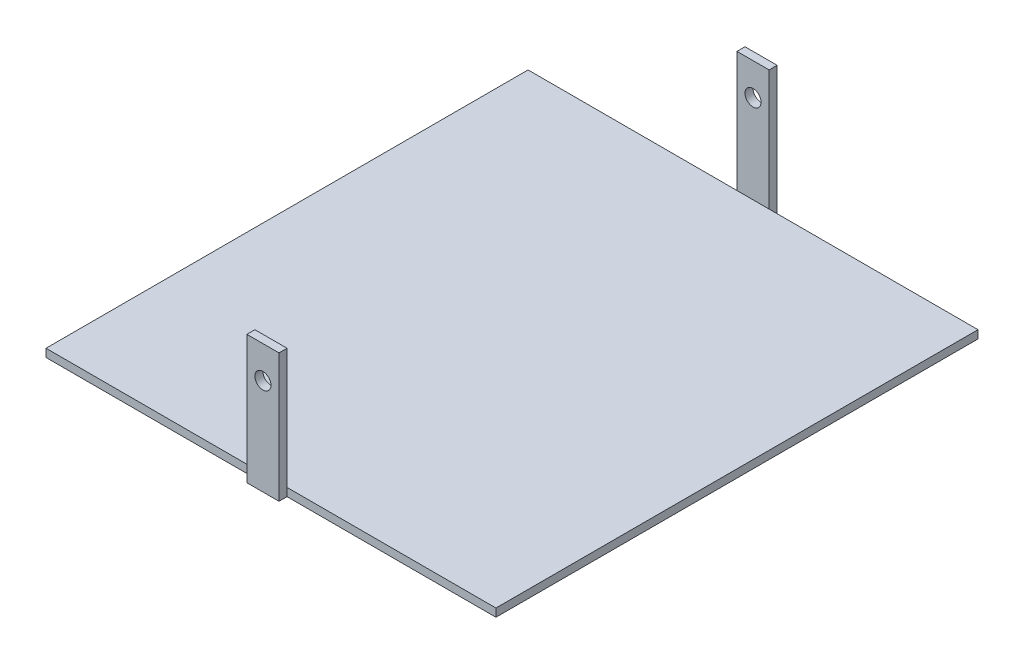
ISO-10303-21;
HEADER;
FILE_DESCRIPTION(('STEP AP214'),'2;1');
FILE_NAME('part.step','',(''),(''),'','','');
FILE_SCHEMA(('AUTOMOTIVE_DESIGN { 1 0 10303 214 1 1 1 1 }'));
ENDSEC;
DATA;
#1=APPLICATION_CONTEXT('core data for automotive mechanical design processes');
#2=APPLICATION_PROTOCOL_DEFINITION('international standard','automotive_design',2000,#1);
#3=PRODUCT_CONTEXT('',#1,'mechanical');
#4=PRODUCT('Part','Part','',(#3));
#5=PRODUCT_RELATED_PRODUCT_CATEGORY('part','',(#4));
#6=PRODUCT_DEFINITION_FORMATION('','',#4);
#7=PRODUCT_DEFINITION_CONTEXT('part definition',#1,'design');
#8=PRODUCT_DEFINITION('design','',#6,#7);
#9=PRODUCT_DEFINITION_SHAPE('','',#8);
#10=(LENGTH_UNIT() NAMED_UNIT(*) SI_UNIT(.MILLI.,.METRE.));
#11=(NAMED_UNIT(*) PLANE_ANGLE_UNIT() SI_UNIT($,.RADIAN.));
#12=(NAMED_UNIT(*) SI_UNIT($,.STERADIAN.) SOLID_ANGLE_UNIT());
#13=UNCERTAINTY_MEASURE_WITH_UNIT(LENGTH_MEASURE(1.E-05),#10,'distance_accuracy_value','');
#14=(GEOMETRIC_REPRESENTATION_CONTEXT(3) GLOBAL_UNCERTAINTY_ASSIGNED_CONTEXT((#13)) GLOBAL_UNIT_ASSIGNED_CONTEXT((#10,
#11,#12)) REPRESENTATION_CONTEXT('',''));
#15=CARTESIAN_POINT('',(0.,0.,0.));
#16=DIRECTION('',(0.,0.,1.));
#17=DIRECTION('',(1.,0.,0.));
#18=AXIS2_PLACEMENT_3D('',#15,#16,#17);
#19=CARTESIAN_POINT('',(0.,5.,-300.));
#20=DIRECTION('',(0.,0.,1.));
#21=DIRECTION('',(1.,0.,0.));
#22=AXIS2_PLACEMENT_3D('',#19,#20,#21);
#23=PLANE('',#22);
#24=DIRECTION('',(-1.,0.,0.));
#25=VECTOR('',#24,1.);
#26=CARTESIAN_POINT('',(0.,5.,-300.));
#27=LINE('',#26,#25);
#28=CARTESIAN_POINT('',(130.,5.,-300.));
#29=VERTEX_POINT('',#28);
#30=CARTESIAN_POINT('',(0.,5.,-300.));
#31=VERTEX_POINT('',#30);
#32=EDGE_CURVE('E257',#29,#31,#27,.T.);
#33=ORIENTED_EDGE('',*,*,#32,.F.);
#34=DIRECTION('',(0.,-1.,0.));
#35=VECTOR('',#34,1.);
#36=CARTESIAN_POINT('',(130.,80.,-300.));
#37=LINE('',#36,#35);
#38=CARTESIAN_POINT('',(130.,0.,-300.));
#39=VERTEX_POINT('',#38);
#40=EDGE_CURVE('E11',#29,#39,#37,.T.);
#41=ORIENTED_EDGE('',*,*,#40,.T.);
#42=DIRECTION('',(-1.,0.,0.));
#43=VECTOR('',#42,1.);
#44=CARTESIAN_POINT('',(0.,0.,-300.));
#45=LINE('',#44,#43);
#46=CARTESIAN_POINT('',(0.,0.,-300.));
#47=VERTEX_POINT('',#46);
#48=EDGE_CURVE('E174',#39,#47,#45,.T.);
#49=ORIENTED_EDGE('',*,*,#48,.T.);
#50=DIRECTION('',(0.,-1.,0.));
#51=VECTOR('',#50,1.);
#52=CARTESIAN_POINT('',(0.,5.,-300.));
#53=LINE('',#52,#51);
#54=EDGE_CURVE('E236',#31,#47,#53,.T.);
#55=ORIENTED_EDGE('',*,*,#54,.F.);
#56=EDGE_LOOP('',(#33,#41,#49,#55));
#57=FACE_BOUND('',#56,.T.);
#58=ADVANCED_FACE('F32',(#57),#23,.F.);
#59=CARTESIAN_POINT('',(0.,5.,0.));
#60=DIRECTION('',(0.,0.,-1.));
#61=DIRECTION('',(-1.,0.,0.));
#62=AXIS2_PLACEMENT_3D('',#59,#60,#61);
#63=PLANE('',#62);
#64=DIRECTION('',(0.,-1.,0.));
#65=VECTOR('',#64,1.);
#66=CARTESIAN_POINT('',(130.,80.,0.));
#67=LINE('',#66,#65);
#68=CARTESIAN_POINT('',(130.,5.,0.));
#69=VERTEX_POINT('',#68);
#70=CARTESIAN_POINT('',(130.,0.,0.));
#71=VERTEX_POINT('',#70);
#72=EDGE_CURVE('E41',#69,#71,#67,.T.);
#73=ORIENTED_EDGE('',*,*,#72,.F.);
#74=DIRECTION('',(1.,0.,0.));
#75=VECTOR('',#74,1.);
#76=CARTESIAN_POINT('',(0.,5.,0.));
#77=LINE('',#76,#75);
#78=CARTESIAN_POINT('',(0.,5.,0.));
#79=VERTEX_POINT('',#78);
#80=EDGE_CURVE('E260',#79,#69,#77,.T.);
#81=ORIENTED_EDGE('',*,*,#80,.F.);
#82=DIRECTION('',(0.,-1.,0.));
#83=VECTOR('',#82,1.);
#84=CARTESIAN_POINT('',(0.,5.,0.));
#85=LINE('',#84,#83);
#86=CARTESIAN_POINT('',(0.,0.,0.));
#87=VERTEX_POINT('',#86);
#88=EDGE_CURVE('E211',#79,#87,#85,.T.);
#89=ORIENTED_EDGE('',*,*,#88,.T.);
#90=DIRECTION('',(1.,0.,0.));
#91=VECTOR('',#90,1.);
#92=CARTESIAN_POINT('',(0.,0.,0.));
#93=LINE('',#92,#91);
#94=EDGE_CURVE('E248',#87,#71,#93,.T.);
#95=ORIENTED_EDGE('',*,*,#94,.T.);
#96=EDGE_LOOP('',(#73,#81,#89,#95));
#97=FACE_BOUND('',#96,.T.);
#98=ADVANCED_FACE('F313',(#97),#63,.F.);
#99=DIRECTION('',(0.,1.,0.));
#100=VECTOR('',#99,1.);
#101=CARTESIAN_POINT('',(150.,80.,0.));
#102=LINE('',#101,#100);
#103=CARTESIAN_POINT('',(150.,0.,0.));
#104=VERTEX_POINT('',#103);
#105=CARTESIAN_POINT('',(150.,5.,0.));
#106=VERTEX_POINT('',#105);
#107=EDGE_CURVE('E215',#104,#106,#102,.T.);
#108=ORIENTED_EDGE('',*,*,#107,.F.);
#109=CARTESIAN_POINT('',(280.,0.,0.));
#110=VERTEX_POINT('',#109);
#111=EDGE_CURVE('E212',#104,#110,#93,.T.);
#112=ORIENTED_EDGE('',*,*,#111,.T.);
#113=DIRECTION('',(0.,-1.,0.));
#114=VECTOR('',#113,1.);
#115=CARTESIAN_POINT('',(280.,5.,0.));
#116=LINE('',#115,#114);
#117=CARTESIAN_POINT('',(280.,5.,0.));
#118=VERTEX_POINT('',#117);
#119=EDGE_CURVE('E244',#118,#110,#116,.T.);
#120=ORIENTED_EDGE('',*,*,#119,.F.);
#121=EDGE_CURVE('E263',#106,#118,#77,.T.);
#122=ORIENTED_EDGE('',*,*,#121,.F.);
#123=EDGE_LOOP('',(#108,#112,#120,#122));
#124=FACE_BOUND('',#123,.T.);
#125=ADVANCED_FACE('F292',(#124),#63,.F.);
#126=CARTESIAN_POINT('',(0.,5.,0.));
#127=DIRECTION('',(1.,0.,0.));
#128=DIRECTION('',(0.,0.,-1.));
#129=AXIS2_PLACEMENT_3D('',#126,#127,#128);
#130=PLANE('',#129);
#131=DIRECTION('',(0.,0.,1.));
#132=VECTOR('',#131,1.);
#133=CARTESIAN_POINT('',(0.,0.,0.));
#134=LINE('',#133,#132);
#135=EDGE_CURVE('E227',#47,#87,#134,.T.);
#136=ORIENTED_EDGE('',*,*,#135,.T.);
#137=ORIENTED_EDGE('',*,*,#88,.F.);
#138=DIRECTION('',(0.,0.,1.));
#139=VECTOR('',#138,1.);
#140=CARTESIAN_POINT('',(0.,5.,0.));
#141=LINE('',#140,#139);
#142=EDGE_CURVE('E231',#31,#79,#141,.T.);
#143=ORIENTED_EDGE('',*,*,#142,.F.);
#144=ORIENTED_EDGE('',*,*,#54,.T.);
#145=EDGE_LOOP('',(#136,#137,#143,#144));
#146=FACE_BOUND('',#145,.T.);
#147=ADVANCED_FACE('F34',(#146),#130,.F.);
#148=CARTESIAN_POINT('',(280.,5.,0.));
#149=DIRECTION('',(-1.,0.,0.));
#150=DIRECTION('',(0.,0.,1.));
#151=AXIS2_PLACEMENT_3D('',#148,#149,#150);
#152=PLANE('',#151);
#153=DIRECTION('',(0.,0.,-1.));
#154=VECTOR('',#153,1.);
#155=CARTESIAN_POINT('',(280.,0.,0.));
#156=LINE('',#155,#154);
#157=CARTESIAN_POINT('',(280.,0.,-300.));
#158=VERTEX_POINT('',#157);
#159=EDGE_CURVE('E235',#110,#158,#156,.T.);
#160=ORIENTED_EDGE('',*,*,#159,.T.);
#161=DIRECTION('',(0.,-1.,0.));
#162=VECTOR('',#161,1.);
#163=CARTESIAN_POINT('',(280.,5.,-300.));
#164=LINE('',#163,#162);
#165=CARTESIAN_POINT('',(280.,5.,-300.));
#166=VERTEX_POINT('',#165);
#167=EDGE_CURVE('E240',#166,#158,#164,.T.);
#168=ORIENTED_EDGE('',*,*,#167,.F.);
#169=DIRECTION('',(0.,0.,-1.));
#170=VECTOR('',#169,1.);
#171=CARTESIAN_POINT('',(280.,5.,0.));
#172=LINE('',#171,#170);
#173=EDGE_CURVE('E258',#118,#166,#172,.T.);
#174=ORIENTED_EDGE('',*,*,#173,.F.);
#175=ORIENTED_EDGE('',*,*,#119,.T.);
#176=EDGE_LOOP('',(#160,#168,#174,#175));
#177=FACE_BOUND('',#176,.T.);
#178=ADVANCED_FACE('F296',(#177),#152,.F.);
#179=CARTESIAN_POINT('',(150.,0.,-300.));
#180=VERTEX_POINT('',#179);
#181=EDGE_CURVE('E229',#158,#180,#45,.T.);
#182=ORIENTED_EDGE('',*,*,#181,.T.);
#183=DIRECTION('',(0.,1.,0.));
#184=VECTOR('',#183,1.);
#185=CARTESIAN_POINT('',(150.,80.,-300.));
#186=LINE('',#185,#184);
#187=CARTESIAN_POINT('',(150.,5.,-300.));
#188=VERTEX_POINT('',#187);
#189=EDGE_CURVE('E157',#180,#188,#186,.T.);
#190=ORIENTED_EDGE('',*,*,#189,.T.);
#191=EDGE_CURVE('E241',#166,#188,#27,.T.);
#192=ORIENTED_EDGE('',*,*,#191,.F.);
#193=ORIENTED_EDGE('',*,*,#167,.T.);
#194=EDGE_LOOP('',(#182,#190,#192,#193));
#195=FACE_BOUND('',#194,.T.);
#196=ADVANCED_FACE('F300',(#195),#23,.F.);
#197=CARTESIAN_POINT('',(0.,5.,0.));
#198=DIRECTION('',(0.,-1.,0.));
#199=DIRECTION('',(0.,0.,-1.));
#200=AXIS2_PLACEMENT_3D('',#197,#198,#199);
#201=PLANE('',#200);
#202=ORIENTED_EDGE('',*,*,#142,.T.);
#203=ORIENTED_EDGE('',*,*,#80,.T.);
#204=EDGE_CURVE('E262',#69,#106,#77,.T.);
#205=ORIENTED_EDGE('',*,*,#204,.T.);
#206=ORIENTED_EDGE('',*,*,#121,.T.);
#207=ORIENTED_EDGE('',*,*,#173,.T.);
#208=ORIENTED_EDGE('',*,*,#191,.T.);
#209=EDGE_CURVE('E256',#188,#29,#27,.T.);
#210=ORIENTED_EDGE('',*,*,#209,.T.);
#211=ORIENTED_EDGE('',*,*,#32,.T.);
#212=EDGE_LOOP('',(#202,#203,#205,#206,#207,#208,#210,#211));
#213=FACE_BOUND('',#212,.T.);
#214=ADVANCED_FACE('F288',(#213),#201,.F.);
#215=CARTESIAN_POINT('',(0.,0.,0.));
#216=DIRECTION('',(0.,-1.,0.));
#217=DIRECTION('',(0.,0.,-1.));
#218=AXIS2_PLACEMENT_3D('',#215,#216,#217);
#219=PLANE('',#218);
#220=ORIENTED_EDGE('',*,*,#135,.F.);
#221=ORIENTED_EDGE('',*,*,#48,.F.);
#222=DIRECTION('',(0.,0.,1.));
#223=VECTOR('',#222,1.);
#224=CARTESIAN_POINT('',(130.,0.,-305.));
#225=LINE('',#224,#223);
#226=CARTESIAN_POINT('',(130.,0.,-305.));
#227=VERTEX_POINT('',#226);
#228=EDGE_CURVE('E166',#227,#39,#225,.T.);
#229=ORIENTED_EDGE('',*,*,#228,.F.);
#230=DIRECTION('',(1.,0.,0.));
#231=VECTOR('',#230,1.);
#232=CARTESIAN_POINT('',(130.,0.,-305.));
#233=LINE('',#232,#231);
#234=CARTESIAN_POINT('',(150.,0.,-305.));
#235=VERTEX_POINT('',#234);
#236=EDGE_CURVE('E156',#227,#235,#233,.T.);
#237=ORIENTED_EDGE('',*,*,#236,.T.);
#238=DIRECTION('',(0.,0.,1.));
#239=VECTOR('',#238,1.);
#240=CARTESIAN_POINT('',(150.,0.,-305.));
#241=LINE('',#240,#239);
#242=EDGE_CURVE('E177',#235,#180,#241,.T.);
#243=ORIENTED_EDGE('',*,*,#242,.T.);
#244=ORIENTED_EDGE('',*,*,#181,.F.);
#245=ORIENTED_EDGE('',*,*,#159,.F.);
#246=ORIENTED_EDGE('',*,*,#111,.F.);
#247=DIRECTION('',(0.,0.,-1.));
#248=VECTOR('',#247,1.);
#249=CARTESIAN_POINT('',(150.,0.,5.));
#250=LINE('',#249,#248);
#251=CARTESIAN_POINT('',(150.,0.,5.));
#252=VERTEX_POINT('',#251);
#253=EDGE_CURVE('E218',#252,#104,#250,.T.);
#254=ORIENTED_EDGE('',*,*,#253,.F.);
#255=DIRECTION('',(1.,0.,0.));
#256=VECTOR('',#255,1.);
#257=CARTESIAN_POINT('',(130.,0.,5.));
#258=LINE('',#257,#256);
#259=CARTESIAN_POINT('',(130.,0.,5.));
#260=VERTEX_POINT('',#259);
#261=EDGE_CURVE('E194',#260,#252,#258,.T.);
#262=ORIENTED_EDGE('',*,*,#261,.F.);
#263=DIRECTION('',(0.,0.,-1.));
#264=VECTOR('',#263,1.);
#265=CARTESIAN_POINT('',(130.,0.,5.));
#266=LINE('',#265,#264);
#267=EDGE_CURVE('E221',#260,#71,#266,.T.);
#268=ORIENTED_EDGE('',*,*,#267,.T.);
#269=ORIENTED_EDGE('',*,*,#94,.F.);
#270=EDGE_LOOP('',(#220,#221,#229,#237,#243,#244,#245,#246,#254,#262,#268,#269));
#271=FACE_BOUND('',#270,.T.);
#272=ADVANCED_FACE('F315',(#271),#219,.T.);
#273=CARTESIAN_POINT('',(0.,0.,5.));
#274=DIRECTION('',(0.,0.,1.));
#275=DIRECTION('',(1.,0.,0.));
#276=AXIS2_PLACEMENT_3D('',#273,#274,#275);
#277=PLANE('',#276);
#278=DIRECTION('',(0.,-1.,0.));
#279=VECTOR('',#278,1.);
#280=CARTESIAN_POINT('',(130.,80.,5.));
#281=LINE('',#280,#279);
#282=CARTESIAN_POINT('',(130.,80.,5.));
#283=VERTEX_POINT('',#282);
#284=EDGE_CURVE('E191',#283,#260,#281,.T.);
#285=ORIENTED_EDGE('',*,*,#284,.T.);
#286=ORIENTED_EDGE('',*,*,#261,.T.);
#287=DIRECTION('',(0.,1.,0.));
#288=VECTOR('',#287,1.);
#289=CARTESIAN_POINT('',(150.,80.,5.));
#290=LINE('',#289,#288);
#291=CARTESIAN_POINT('',(150.,80.,5.));
#292=VERTEX_POINT('',#291);
#293=EDGE_CURVE('E197',#252,#292,#290,.T.);
#294=ORIENTED_EDGE('',*,*,#293,.T.);
#295=DIRECTION('',(-1.,0.,0.));
#296=VECTOR('',#295,1.);
#297=CARTESIAN_POINT('',(130.,80.,5.));
#298=LINE('',#297,#296);
#299=EDGE_CURVE('E199',#292,#283,#298,.T.);
#300=ORIENTED_EDGE('',*,*,#299,.T.);
#301=EDGE_LOOP('',(#285,#286,#294,#300));
#302=FACE_BOUND('',#301,.T.);
#303=CARTESIAN_POINT('',(140.,60.,5.));
#304=DIRECTION('',(0.,0.,1.));
#305=DIRECTION('',(1.,0.,0.));
#306=AXIS2_PLACEMENT_3D('',#303,#304,#305);
#307=CIRCLE('',#306,5.00000000000002);
#308=CARTESIAN_POINT('',(145.,60.,5.));
#309=VERTEX_POINT('',#308);
#310=EDGE_CURVE('E185',#309,#309,#307,.T.);
#311=ORIENTED_EDGE('',*,*,#310,.F.);
#312=EDGE_LOOP('',(#311));
#313=FACE_BOUND('',#312,.T.);
#314=ADVANCED_FACE('F319',(#302,#313),#277,.T.);
#315=CARTESIAN_POINT('',(0.,0.,0.));
#316=DIRECTION('',(0.,0.,1.));
#317=DIRECTION('',(1.,0.,0.));
#318=AXIS2_PLACEMENT_3D('',#315,#316,#317);
#319=PLANE('',#318);
#320=ORIENTED_EDGE('',*,*,#204,.F.);
#321=CARTESIAN_POINT('',(130.,80.,0.));
#322=VERTEX_POINT('',#321);
#323=EDGE_CURVE('E188',#322,#69,#67,.T.);
#324=ORIENTED_EDGE('',*,*,#323,.F.);
#325=DIRECTION('',(-1.,0.,0.));
#326=VECTOR('',#325,1.);
#327=CARTESIAN_POINT('',(130.,80.,0.));
#328=LINE('',#327,#326);
#329=CARTESIAN_POINT('',(150.,80.,0.));
#330=VERTEX_POINT('',#329);
#331=EDGE_CURVE('E195',#330,#322,#328,.T.);
#332=ORIENTED_EDGE('',*,*,#331,.F.);
#333=EDGE_CURVE('E205',#106,#330,#102,.T.);
#334=ORIENTED_EDGE('',*,*,#333,.F.);
#335=EDGE_LOOP('',(#320,#324,#332,#334));
#336=FACE_BOUND('',#335,.T.);
#337=CARTESIAN_POINT('',(140.,60.,0.));
#338=DIRECTION('',(0.,0.,1.));
#339=DIRECTION('',(1.,0.,0.));
#340=AXIS2_PLACEMENT_3D('',#337,#338,#339);
#341=CIRCLE('',#340,5.00000000000002);
#342=CARTESIAN_POINT('',(145.,60.,0.));
#343=VERTEX_POINT('',#342);
#344=EDGE_CURVE('E146',#343,#343,#341,.T.);
#345=ORIENTED_EDGE('',*,*,#344,.T.);
#346=EDGE_LOOP('',(#345));
#347=FACE_BOUND('',#346,.T.);
#348=ADVANCED_FACE('F283',(#336,#347),#319,.F.);
#349=CARTESIAN_POINT('',(130.,80.,5.));
#350=DIRECTION('',(1.,0.,0.));
#351=DIRECTION('',(0.,0.,-1.));
#352=AXIS2_PLACEMENT_3D('',#349,#350,#351);
#353=PLANE('',#352);
#354=ORIENTED_EDGE('',*,*,#323,.T.);
#355=ORIENTED_EDGE('',*,*,#72,.T.);
#356=ORIENTED_EDGE('',*,*,#267,.F.);
#357=ORIENTED_EDGE('',*,*,#284,.F.);
#358=DIRECTION('',(0.,0.,-1.));
#359=VECTOR('',#358,1.);
#360=CARTESIAN_POINT('',(130.,80.,5.));
#361=LINE('',#360,#359);
#362=EDGE_CURVE('E201',#283,#322,#361,.T.);
#363=ORIENTED_EDGE('',*,*,#362,.T.);
#364=EDGE_LOOP('',(#354,#355,#356,#357,#363));
#365=FACE_BOUND('',#364,.T.);
#366=ADVANCED_FACE('F280',(#365),#353,.F.);
#367=CARTESIAN_POINT('',(150.,80.,5.));
#368=DIRECTION('',(-1.,0.,0.));
#369=DIRECTION('',(0.,0.,1.));
#370=AXIS2_PLACEMENT_3D('',#367,#368,#369);
#371=PLANE('',#370);
#372=ORIENTED_EDGE('',*,*,#107,.T.);
#373=ORIENTED_EDGE('',*,*,#333,.T.);
#374=DIRECTION('',(0.,0.,-1.));
#375=VECTOR('',#374,1.);
#376=CARTESIAN_POINT('',(150.,80.,5.));
#377=LINE('',#376,#375);
#378=EDGE_CURVE('E222',#292,#330,#377,.T.);
#379=ORIENTED_EDGE('',*,*,#378,.F.);
#380=ORIENTED_EDGE('',*,*,#293,.F.);
#381=ORIENTED_EDGE('',*,*,#253,.T.);
#382=EDGE_LOOP('',(#372,#373,#379,#380,#381));
#383=FACE_BOUND('',#382,.T.);
#384=ADVANCED_FACE('F322',(#383),#371,.F.);
#385=CARTESIAN_POINT('',(130.,80.,5.));
#386=DIRECTION('',(0.,-1.,0.));
#387=DIRECTION('',(0.,0.,-1.));
#388=AXIS2_PLACEMENT_3D('',#385,#386,#387);
#389=PLANE('',#388);
#390=ORIENTED_EDGE('',*,*,#331,.T.);
#391=ORIENTED_EDGE('',*,*,#362,.F.);
#392=ORIENTED_EDGE('',*,*,#299,.F.);
#393=ORIENTED_EDGE('',*,*,#378,.T.);
#394=EDGE_LOOP('',(#390,#391,#392,#393));
#395=FACE_BOUND('',#394,.T.);
#396=ADVANCED_FACE('F272',(#395),#389,.F.);
#397=CARTESIAN_POINT('',(140.,60.,5.));
#398=DIRECTION('',(0.,0.,-1.));
#399=DIRECTION('',(-1.,0.,0.));
#400=AXIS2_PLACEMENT_3D('',#397,#398,#399);
#401=CYLINDRICAL_SURFACE('',#400,5.00000000000002);
#402=ORIENTED_EDGE('',*,*,#310,.T.);
#403=EDGE_LOOP('',(#402));
#404=FACE_BOUND('',#403,.T.);
#405=ORIENTED_EDGE('',*,*,#344,.F.);
#406=EDGE_LOOP('',(#405));
#407=FACE_BOUND('',#406,.T.);
#408=ADVANCED_FACE('F429',(#404,#407),#401,.F.);
#409=CARTESIAN_POINT('',(130.,80.,-305.));
#410=DIRECTION('',(-1.,0.,0.));
#411=DIRECTION('',(0.,0.,1.));
#412=AXIS2_PLACEMENT_3D('',#409,#410,#411);
#413=PLANE('',#412);
#414=CARTESIAN_POINT('',(130.,80.,-300.));
#415=VERTEX_POINT('',#414);
#416=EDGE_CURVE('E141',#415,#29,#37,.T.);
#417=ORIENTED_EDGE('',*,*,#416,.F.);
#418=DIRECTION('',(0.,0.,1.));
#419=VECTOR('',#418,1.);
#420=CARTESIAN_POINT('',(130.,80.,-305.));
#421=LINE('',#420,#419);
#422=CARTESIAN_POINT('',(130.,80.,-305.));
#423=VERTEX_POINT('',#422);
#424=EDGE_CURVE('E135',#423,#415,#421,.T.);
#425=ORIENTED_EDGE('',*,*,#424,.F.);
#426=DIRECTION('',(0.,-1.,0.));
#427=VECTOR('',#426,1.);
#428=CARTESIAN_POINT('',(130.,80.,-305.));
#429=LINE('',#428,#427);
#430=EDGE_CURVE('E138',#423,#227,#429,.T.);
#431=ORIENTED_EDGE('',*,*,#430,.T.);
#432=ORIENTED_EDGE('',*,*,#228,.T.);
#433=ORIENTED_EDGE('',*,*,#40,.F.);
#434=EDGE_LOOP('',(#417,#425,#431,#432,#433));
#435=FACE_BOUND('',#434,.T.);
#436=ADVANCED_FACE('F137',(#435),#413,.T.);
#437=CARTESIAN_POINT('',(130.,80.,-305.));
#438=DIRECTION('',(0.,1.,0.));
#439=DIRECTION('',(0.,0.,1.));
#440=AXIS2_PLACEMENT_3D('',#437,#438,#439);
#441=PLANE('',#440);
#442=DIRECTION('',(-1.,0.,0.));
#443=VECTOR('',#442,1.);
#444=CARTESIAN_POINT('',(130.,80.,-300.));
#445=LINE('',#444,#443);
#446=CARTESIAN_POINT('',(150.,80.,-300.));
#447=VERTEX_POINT('',#446);
#448=EDGE_CURVE('E169',#447,#415,#445,.T.);
#449=ORIENTED_EDGE('',*,*,#448,.F.);
#450=DIRECTION('',(0.,0.,1.));
#451=VECTOR('',#450,1.);
#452=CARTESIAN_POINT('',(150.,80.,-305.));
#453=LINE('',#452,#451);
#454=CARTESIAN_POINT('',(150.,80.,-305.));
#455=VERTEX_POINT('',#454);
#456=EDGE_CURVE('E147',#455,#447,#453,.T.);
#457=ORIENTED_EDGE('',*,*,#456,.F.);
#458=DIRECTION('',(-1.,0.,0.));
#459=VECTOR('',#458,1.);
#460=CARTESIAN_POINT('',(130.,80.,-305.));
#461=LINE('',#460,#459);
#462=EDGE_CURVE('E153',#455,#423,#461,.T.);
#463=ORIENTED_EDGE('',*,*,#462,.T.);
#464=ORIENTED_EDGE('',*,*,#424,.T.);
#465=EDGE_LOOP('',(#449,#457,#463,#464));
#466=FACE_BOUND('',#465,.T.);
#467=ADVANCED_FACE('F159',(#466),#441,.T.);
#468=CARTESIAN_POINT('',(150.,80.,-305.));
#469=DIRECTION('',(1.,0.,0.));
#470=DIRECTION('',(0.,0.,-1.));
#471=AXIS2_PLACEMENT_3D('',#468,#469,#470);
#472=PLANE('',#471);
#473=ORIENTED_EDGE('',*,*,#189,.F.);
#474=ORIENTED_EDGE('',*,*,#242,.F.);
#475=DIRECTION('',(0.,1.,0.));
#476=VECTOR('',#475,1.);
#477=CARTESIAN_POINT('',(150.,80.,-305.));
#478=LINE('',#477,#476);
#479=EDGE_CURVE('E160',#235,#455,#478,.T.);
#480=ORIENTED_EDGE('',*,*,#479,.T.);
#481=ORIENTED_EDGE('',*,*,#456,.T.);
#482=EDGE_CURVE('E49',#188,#447,#186,.T.);
#483=ORIENTED_EDGE('',*,*,#482,.F.);
#484=EDGE_LOOP('',(#473,#474,#480,#481,#483));
#485=FACE_BOUND('',#484,.T.);
#486=ADVANCED_FACE('F323',(#485),#472,.T.);
#487=CARTESIAN_POINT('',(0.,0.,-305.));
#488=DIRECTION('',(0.,0.,-1.));
#489=DIRECTION('',(1.,0.,0.));
#490=AXIS2_PLACEMENT_3D('',#487,#488,#489);
#491=PLANE('',#490);
#492=CARTESIAN_POINT('',(140.,60.,-305.));
#493=DIRECTION('',(0.,0.,1.));
#494=DIRECTION('',(1.,0.,0.));
#495=AXIS2_PLACEMENT_3D('',#492,#493,#494);
#496=CIRCLE('',#495,5.00000000000002);
#497=CARTESIAN_POINT('',(145.,60.,-305.));
#498=VERTEX_POINT('',#497);
#499=EDGE_CURVE('E170',#498,#498,#496,.T.);
#500=ORIENTED_EDGE('',*,*,#499,.T.);
#501=EDGE_LOOP('',(#500));
#502=FACE_BOUND('',#501,.T.);
#503=ORIENTED_EDGE('',*,*,#430,.F.);
#504=ORIENTED_EDGE('',*,*,#462,.F.);
#505=ORIENTED_EDGE('',*,*,#479,.F.);
#506=ORIENTED_EDGE('',*,*,#236,.F.);
#507=EDGE_LOOP('',(#503,#504,#505,#506));
#508=FACE_BOUND('',#507,.T.);
#509=ADVANCED_FACE('F151',(#502,#508),#491,.T.);
#510=CARTESIAN_POINT('',(0.,0.,-300.));
#511=DIRECTION('',(0.,0.,-1.));
#512=DIRECTION('',(1.,0.,0.));
#513=AXIS2_PLACEMENT_3D('',#510,#511,#512);
#514=PLANE('',#513);
#515=ORIENTED_EDGE('',*,*,#209,.F.);
#516=ORIENTED_EDGE('',*,*,#482,.T.);
#517=ORIENTED_EDGE('',*,*,#448,.T.);
#518=ORIENTED_EDGE('',*,*,#416,.T.);
#519=EDGE_LOOP('',(#515,#516,#517,#518));
#520=FACE_BOUND('',#519,.T.);
#521=CARTESIAN_POINT('',(140.,60.,-300.));
#522=DIRECTION('',(0.,0.,1.));
#523=DIRECTION('',(1.,0.,0.));
#524=AXIS2_PLACEMENT_3D('',#521,#522,#523);
#525=CIRCLE('',#524,5.00000000000002);
#526=CARTESIAN_POINT('',(145.,60.,-300.));
#527=VERTEX_POINT('',#526);
#528=EDGE_CURVE('E487',#527,#527,#525,.T.);
#529=ORIENTED_EDGE('',*,*,#528,.F.);
#530=EDGE_LOOP('',(#529));
#531=FACE_BOUND('',#530,.T.);
#532=ADVANCED_FACE('F305',(#520,#531),#514,.F.);
#533=CARTESIAN_POINT('',(140.,60.,-305.));
#534=DIRECTION('',(0.,0.,1.));
#535=DIRECTION('',(1.,0.,0.));
#536=AXIS2_PLACEMENT_3D('',#533,#534,#535);
#537=CYLINDRICAL_SURFACE('',#536,5.00000000000002);
#538=ORIENTED_EDGE('',*,*,#499,.F.);
#539=EDGE_LOOP('',(#538));
#540=FACE_BOUND('',#539,.T.);
#541=ORIENTED_EDGE('',*,*,#528,.T.);
#542=EDGE_LOOP('',(#541));
#543=FACE_BOUND('',#542,.T.);
#544=ADVANCED_FACE('F470',(#540,#543),#537,.F.);
#545=CLOSED_SHELL('',(#58,#98,#125,#147,#178,#196,#214,#272,#314,#348,#366,#384,#396,#408,#436,
#467,#486,#509,#532,#544));
#546=MANIFOLD_SOLID_BREP('B2',#545);
#547=ADVANCED_BREP_SHAPE_REPRESENTATION('',(#18,#546),#14);
#548=SHAPE_DEFINITION_REPRESENTATION(#9,#547);
ENDSEC;
END-ISO-10303-21;
